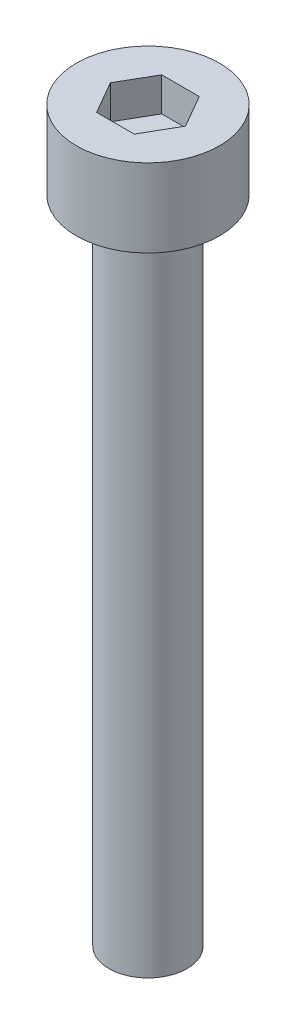
ISO-10303-21;
HEADER;
FILE_DESCRIPTION(('STEP AP214'),'2;1');
FILE_NAME('part.step','',(''),(''),'','','');
FILE_SCHEMA(('AUTOMOTIVE_DESIGN { 1 0 10303 214 1 1 1 1 }'));
ENDSEC;
DATA;
#1=APPLICATION_CONTEXT('core data for automotive mechanical design processes');
#2=APPLICATION_PROTOCOL_DEFINITION('international standard','automotive_design',2000,#1);
#3=PRODUCT_CONTEXT('',#1,'mechanical');
#4=PRODUCT('Part','Part','',(#3));
#5=PRODUCT_RELATED_PRODUCT_CATEGORY('part','',(#4));
#6=PRODUCT_DEFINITION_FORMATION('','',#4);
#7=PRODUCT_DEFINITION_CONTEXT('part definition',#1,'design');
#8=PRODUCT_DEFINITION('design','',#6,#7);
#9=PRODUCT_DEFINITION_SHAPE('','',#8);
#10=(LENGTH_UNIT() NAMED_UNIT(*) SI_UNIT(.MILLI.,.METRE.));
#11=(NAMED_UNIT(*) PLANE_ANGLE_UNIT() SI_UNIT($,.RADIAN.));
#12=(NAMED_UNIT(*) SI_UNIT($,.STERADIAN.) SOLID_ANGLE_UNIT());
#13=UNCERTAINTY_MEASURE_WITH_UNIT(LENGTH_MEASURE(1.E-05),#10,'distance_accuracy_value','');
#14=(GEOMETRIC_REPRESENTATION_CONTEXT(3) GLOBAL_UNCERTAINTY_ASSIGNED_CONTEXT((#13)) GLOBAL_UNIT_ASSIGNED_CONTEXT((#10,
#11,#12)) REPRESENTATION_CONTEXT('',''));
#15=CARTESIAN_POINT('',(0.,0.,0.));
#16=DIRECTION('',(0.,0.,1.));
#17=DIRECTION('',(1.,0.,0.));
#18=AXIS2_PLACEMENT_3D('',#15,#16,#17);
#19=CARTESIAN_POINT('',(0.,3.,0.));
#20=DIRECTION('',(0.,-1.,0.));
#21=DIRECTION('',(0.,0.,-1.));
#22=AXIS2_PLACEMENT_3D('',#19,#20,#21);
#23=CYLINDRICAL_SURFACE('',#22,2.75);
#24=CARTESIAN_POINT('',(0.,3.,0.));
#25=DIRECTION('',(0.,1.,0.));
#26=DIRECTION('',(0.,0.,1.));
#27=AXIS2_PLACEMENT_3D('',#24,#25,#26);
#28=CIRCLE('',#27,2.75);
#29=CARTESIAN_POINT('',(0.,3.,2.75));
#30=VERTEX_POINT('',#29);
#31=EDGE_CURVE('E45',#30,#30,#28,.T.);
#32=ORIENTED_EDGE('',*,*,#31,.F.);
#33=EDGE_LOOP('',(#32));
#34=FACE_BOUND('',#33,.T.);
#35=CARTESIAN_POINT('',(0.,0.,0.));
#36=DIRECTION('',(0.,1.,0.));
#37=DIRECTION('',(0.,0.,1.));
#38=AXIS2_PLACEMENT_3D('',#35,#36,#37);
#39=CIRCLE('',#38,2.75);
#40=CARTESIAN_POINT('',(0.,0.,2.75));
#41=VERTEX_POINT('',#40);
#42=EDGE_CURVE('E40',#41,#41,#39,.T.);
#43=ORIENTED_EDGE('',*,*,#42,.T.);
#44=EDGE_LOOP('',(#43));
#45=FACE_BOUND('',#44,.T.);
#46=ADVANCED_FACE('F37',(#34,#45),#23,.T.);
#47=CARTESIAN_POINT('',(0.,3.,0.));
#48=DIRECTION('',(0.,1.,0.));
#49=DIRECTION('',(0.,0.,1.));
#50=AXIS2_PLACEMENT_3D('',#47,#48,#49);
#51=PLANE('',#50);
#52=DIRECTION('',(0.5,0.,-0.866025403784439));
#53=VECTOR('',#52,1.);
#54=CARTESIAN_POINT('',(0.721687836487032,3.,1.25));
#55=LINE('',#54,#53);
#56=CARTESIAN_POINT('',(0.721687836487032,3.,1.25));
#57=VERTEX_POINT('',#56);
#58=CARTESIAN_POINT('',(1.44337567297406,3.,0.));
#59=VERTEX_POINT('',#58);
#60=EDGE_CURVE('E53',#57,#59,#55,.T.);
#61=ORIENTED_EDGE('',*,*,#60,.F.);
#62=DIRECTION('',(1.,0.,0.));
#63=VECTOR('',#62,1.);
#64=CARTESIAN_POINT('',(-0.721687836487033,3.,1.25));
#65=LINE('',#64,#63);
#66=CARTESIAN_POINT('',(-0.721687836487033,3.,1.25));
#67=VERTEX_POINT('',#66);
#68=EDGE_CURVE('E137',#67,#57,#65,.T.);
#69=ORIENTED_EDGE('',*,*,#68,.F.);
#70=DIRECTION('',(0.5,0.,0.866025403784439));
#71=VECTOR('',#70,1.);
#72=CARTESIAN_POINT('',(-1.44337567297407,3.,0.));
#73=LINE('',#72,#71);
#74=CARTESIAN_POINT('',(-1.44337567297407,3.,0.));
#75=VERTEX_POINT('',#74);
#76=EDGE_CURVE('E135',#75,#67,#73,.T.);
#77=ORIENTED_EDGE('',*,*,#76,.F.);
#78=DIRECTION('',(-0.5,0.,0.866025403784438));
#79=VECTOR('',#78,1.);
#80=CARTESIAN_POINT('',(-0.721687836487033,3.,-1.25));
#81=LINE('',#80,#79);
#82=CARTESIAN_POINT('',(-0.721687836487033,3.,-1.25));
#83=VERTEX_POINT('',#82);
#84=EDGE_CURVE('E101',#83,#75,#81,.T.);
#85=ORIENTED_EDGE('',*,*,#84,.F.);
#86=DIRECTION('',(-1.,0.,0.));
#87=VECTOR('',#86,1.);
#88=CARTESIAN_POINT('',(0.721687836487032,3.,-1.25));
#89=LINE('',#88,#87);
#90=CARTESIAN_POINT('',(0.721687836487032,3.,-1.25));
#91=VERTEX_POINT('',#90);
#92=EDGE_CURVE('E131',#91,#83,#89,.T.);
#93=ORIENTED_EDGE('',*,*,#92,.F.);
#94=DIRECTION('',(-0.5,0.,-0.866025403784439));
#95=VECTOR('',#94,1.);
#96=CARTESIAN_POINT('',(1.44337567297406,3.,0.));
#97=LINE('',#96,#95);
#98=EDGE_CURVE('E127',#59,#91,#97,.T.);
#99=ORIENTED_EDGE('',*,*,#98,.F.);
#100=EDGE_LOOP('',(#61,#69,#77,#85,#93,#99));
#101=FACE_BOUND('',#100,.T.);
#102=ORIENTED_EDGE('',*,*,#31,.T.);
#103=EDGE_LOOP('',(#102));
#104=FACE_BOUND('',#103,.T.);
#105=ADVANCED_FACE('F155',(#101,#104),#51,.T.);
#106=CARTESIAN_POINT('',(0.,0.,0.));
#107=DIRECTION('',(0.,1.,0.));
#108=DIRECTION('',(0.,0.,1.));
#109=AXIS2_PLACEMENT_3D('',#106,#107,#108);
#110=PLANE('',#109);
#111=CARTESIAN_POINT('',(0.,0.,0.));
#112=DIRECTION('',(0.,-1.,0.));
#113=DIRECTION('',(0.,0.,-1.));
#114=AXIS2_PLACEMENT_3D('',#111,#112,#113);
#115=CIRCLE('',#114,1.5);
#116=CARTESIAN_POINT('',(0.,0.,-1.5));
#117=VERTEX_POINT('',#116);
#118=EDGE_CURVE('E11',#117,#117,#115,.T.);
#119=ORIENTED_EDGE('',*,*,#118,.F.);
#120=EDGE_LOOP('',(#119));
#121=FACE_BOUND('',#120,.T.);
#122=ORIENTED_EDGE('',*,*,#42,.F.);
#123=EDGE_LOOP('',(#122));
#124=FACE_BOUND('',#123,.T.);
#125=ADVANCED_FACE('F152',(#121,#124),#110,.F.);
#126=CARTESIAN_POINT('',(0.721687836487032,1.7,1.25));
#127=DIRECTION('',(0.866025403784439,0.,0.5));
#128=DIRECTION('',(0.5,0.,-0.866025403784439));
#129=AXIS2_PLACEMENT_3D('',#126,#127,#128);
#130=PLANE('',#129);
#131=ORIENTED_EDGE('',*,*,#60,.T.);
#132=DIRECTION('',(0.,1.,0.));
#133=VECTOR('',#132,1.);
#134=CARTESIAN_POINT('',(1.44337567297406,1.7,0.));
#135=LINE('',#134,#133);
#136=CARTESIAN_POINT('',(1.44337567297406,1.7,0.));
#137=VERTEX_POINT('',#136);
#138=EDGE_CURVE('E83',#137,#59,#135,.T.);
#139=ORIENTED_EDGE('',*,*,#138,.F.);
#140=DIRECTION('',(0.5,0.,-0.866025403784439));
#141=VECTOR('',#140,1.);
#142=CARTESIAN_POINT('',(0.721687836487032,1.7,1.25));
#143=LINE('',#142,#141);
#144=CARTESIAN_POINT('',(0.721687836487032,1.7,1.25));
#145=VERTEX_POINT('',#144);
#146=EDGE_CURVE('E139',#145,#137,#143,.T.);
#147=ORIENTED_EDGE('',*,*,#146,.F.);
#148=DIRECTION('',(0.,1.,0.));
#149=VECTOR('',#148,1.);
#150=CARTESIAN_POINT('',(0.721687836487032,1.7,1.25));
#151=LINE('',#150,#149);
#152=EDGE_CURVE('E61',#145,#57,#151,.T.);
#153=ORIENTED_EDGE('',*,*,#152,.T.);
#154=EDGE_LOOP('',(#131,#139,#147,#153));
#155=FACE_BOUND('',#154,.T.);
#156=ADVANCED_FACE('F154',(#155),#130,.F.);
#157=CARTESIAN_POINT('',(-0.721687836487033,1.7,1.25));
#158=DIRECTION('',(0.,0.,1.));
#159=DIRECTION('',(1.,0.,0.));
#160=AXIS2_PLACEMENT_3D('',#157,#158,#159);
#161=PLANE('',#160);
#162=ORIENTED_EDGE('',*,*,#68,.T.);
#163=ORIENTED_EDGE('',*,*,#152,.F.);
#164=DIRECTION('',(1.,0.,0.));
#165=VECTOR('',#164,1.);
#166=CARTESIAN_POINT('',(-0.721687836487033,1.7,1.25));
#167=LINE('',#166,#165);
#168=CARTESIAN_POINT('',(-0.721687836487033,1.7,1.25));
#169=VERTEX_POINT('',#168);
#170=EDGE_CURVE('E113',#169,#145,#167,.T.);
#171=ORIENTED_EDGE('',*,*,#170,.F.);
#172=DIRECTION('',(0.,1.,0.));
#173=VECTOR('',#172,1.);
#174=CARTESIAN_POINT('',(-0.721687836487033,1.7,1.25));
#175=LINE('',#174,#173);
#176=EDGE_CURVE('E105',#169,#67,#175,.T.);
#177=ORIENTED_EDGE('',*,*,#176,.T.);
#178=EDGE_LOOP('',(#162,#163,#171,#177));
#179=FACE_BOUND('',#178,.T.);
#180=ADVANCED_FACE('F161',(#179),#161,.F.);
#181=CARTESIAN_POINT('',(-1.44337567297407,1.7,0.));
#182=DIRECTION('',(-0.866025403784439,0.,0.5));
#183=DIRECTION('',(0.5,0.,0.866025403784439));
#184=AXIS2_PLACEMENT_3D('',#181,#182,#183);
#185=PLANE('',#184);
#186=ORIENTED_EDGE('',*,*,#76,.T.);
#187=ORIENTED_EDGE('',*,*,#176,.F.);
#188=DIRECTION('',(0.5,0.,0.866025403784439));
#189=VECTOR('',#188,1.);
#190=CARTESIAN_POINT('',(-1.44337567297407,1.7,0.));
#191=LINE('',#190,#189);
#192=CARTESIAN_POINT('',(-1.44337567297407,1.7,0.));
#193=VERTEX_POINT('',#192);
#194=EDGE_CURVE('E109',#193,#169,#191,.T.);
#195=ORIENTED_EDGE('',*,*,#194,.F.);
#196=DIRECTION('',(0.,1.,0.));
#197=VECTOR('',#196,1.);
#198=CARTESIAN_POINT('',(-1.44337567297407,1.7,0.));
#199=LINE('',#198,#197);
#200=EDGE_CURVE('E94',#193,#75,#199,.T.);
#201=ORIENTED_EDGE('',*,*,#200,.T.);
#202=EDGE_LOOP('',(#186,#187,#195,#201));
#203=FACE_BOUND('',#202,.T.);
#204=ADVANCED_FACE('F110',(#203),#185,.F.);
#205=CARTESIAN_POINT('',(-0.721687836487033,1.7,-1.25));
#206=DIRECTION('',(-0.866025403784439,0.,-0.5));
#207=DIRECTION('',(-0.5,0.,0.866025403784439));
#208=AXIS2_PLACEMENT_3D('',#205,#206,#207);
#209=PLANE('',#208);
#210=ORIENTED_EDGE('',*,*,#84,.T.);
#211=ORIENTED_EDGE('',*,*,#200,.F.);
#212=DIRECTION('',(-0.5,0.,0.866025403784438));
#213=VECTOR('',#212,1.);
#214=CARTESIAN_POINT('',(-0.721687836487033,1.7,-1.25));
#215=LINE('',#214,#213);
#216=CARTESIAN_POINT('',(-0.721687836487033,1.7,-1.25));
#217=VERTEX_POINT('',#216);
#218=EDGE_CURVE('E98',#217,#193,#215,.T.);
#219=ORIENTED_EDGE('',*,*,#218,.F.);
#220=DIRECTION('',(0.,1.,0.));
#221=VECTOR('',#220,1.);
#222=CARTESIAN_POINT('',(-0.721687836487033,1.7,-1.25));
#223=LINE('',#222,#221);
#224=EDGE_CURVE('E106',#217,#83,#223,.T.);
#225=ORIENTED_EDGE('',*,*,#224,.T.);
#226=EDGE_LOOP('',(#210,#211,#219,#225));
#227=FACE_BOUND('',#226,.T.);
#228=ADVANCED_FACE('F96',(#227),#209,.F.);
#229=CARTESIAN_POINT('',(0.721687836487032,1.7,-1.25));
#230=DIRECTION('',(0.,0.,-1.));
#231=DIRECTION('',(-1.,0.,0.));
#232=AXIS2_PLACEMENT_3D('',#229,#230,#231);
#233=PLANE('',#232);
#234=ORIENTED_EDGE('',*,*,#92,.T.);
#235=ORIENTED_EDGE('',*,*,#224,.F.);
#236=DIRECTION('',(-1.,0.,0.));
#237=VECTOR('',#236,1.);
#238=CARTESIAN_POINT('',(0.721687836487032,1.7,-1.25));
#239=LINE('',#238,#237);
#240=CARTESIAN_POINT('',(0.721687836487032,1.7,-1.25));
#241=VERTEX_POINT('',#240);
#242=EDGE_CURVE('E119',#241,#217,#239,.T.);
#243=ORIENTED_EDGE('',*,*,#242,.F.);
#244=DIRECTION('',(0.,1.,0.));
#245=VECTOR('',#244,1.);
#246=CARTESIAN_POINT('',(0.721687836487032,1.7,-1.25));
#247=LINE('',#246,#245);
#248=EDGE_CURVE('E143',#241,#91,#247,.T.);
#249=ORIENTED_EDGE('',*,*,#248,.T.);
#250=EDGE_LOOP('',(#234,#235,#243,#249));
#251=FACE_BOUND('',#250,.T.);
#252=ADVANCED_FACE('F206',(#251),#233,.F.);
#253=CARTESIAN_POINT('',(1.44337567297406,1.7,0.));
#254=DIRECTION('',(0.866025403784439,0.,-0.5));
#255=DIRECTION('',(-0.5,0.,-0.866025403784439));
#256=AXIS2_PLACEMENT_3D('',#253,#254,#255);
#257=PLANE('',#256);
#258=ORIENTED_EDGE('',*,*,#98,.T.);
#259=ORIENTED_EDGE('',*,*,#248,.F.);
#260=DIRECTION('',(-0.5,0.,-0.866025403784439));
#261=VECTOR('',#260,1.);
#262=CARTESIAN_POINT('',(1.44337567297406,1.7,0.));
#263=LINE('',#262,#261);
#264=EDGE_CURVE('E121',#137,#241,#263,.T.);
#265=ORIENTED_EDGE('',*,*,#264,.F.);
#266=ORIENTED_EDGE('',*,*,#138,.T.);
#267=EDGE_LOOP('',(#258,#259,#265,#266));
#268=FACE_BOUND('',#267,.T.);
#269=ADVANCED_FACE('F215',(#268),#257,.F.);
#270=CARTESIAN_POINT('',(0.,1.7,0.));
#271=DIRECTION('',(0.,1.,0.));
#272=DIRECTION('',(0.,0.,1.));
#273=AXIS2_PLACEMENT_3D('',#270,#271,#272);
#274=PLANE('',#273);
#275=ORIENTED_EDGE('',*,*,#146,.T.);
#276=ORIENTED_EDGE('',*,*,#264,.T.);
#277=ORIENTED_EDGE('',*,*,#242,.T.);
#278=ORIENTED_EDGE('',*,*,#218,.T.);
#279=ORIENTED_EDGE('',*,*,#194,.T.);
#280=ORIENTED_EDGE('',*,*,#170,.T.);
#281=EDGE_LOOP('',(#275,#276,#277,#278,#279,#280));
#282=FACE_BOUND('',#281,.T.);
#283=ADVANCED_FACE('F116',(#282),#274,.T.);
#284=CARTESIAN_POINT('',(0.,-25.,0.));
#285=DIRECTION('',(0.,1.,0.));
#286=DIRECTION('',(0.,0.,1.));
#287=AXIS2_PLACEMENT_3D('',#284,#285,#286);
#288=CYLINDRICAL_SURFACE('',#287,1.5);
#289=CARTESIAN_POINT('',(0.,-25.,0.));
#290=DIRECTION('',(0.,-1.,0.));
#291=DIRECTION('',(0.,0.,-1.));
#292=AXIS2_PLACEMENT_3D('',#289,#290,#291);
#293=CIRCLE('',#292,1.5);
#294=CARTESIAN_POINT('',(0.,-25.,-1.5));
#295=VERTEX_POINT('',#294);
#296=EDGE_CURVE('E128',#295,#295,#293,.T.);
#297=ORIENTED_EDGE('',*,*,#296,.F.);
#298=EDGE_LOOP('',(#297));
#299=FACE_BOUND('',#298,.T.);
#300=ORIENTED_EDGE('',*,*,#118,.T.);
#301=EDGE_LOOP('',(#300));
#302=FACE_BOUND('',#301,.T.);
#303=ADVANCED_FACE('F233',(#299,#302),#288,.T.);
#304=CARTESIAN_POINT('',(0.,-25.,0.));
#305=DIRECTION('',(0.,-1.,0.));
#306=DIRECTION('',(0.,0.,-1.));
#307=AXIS2_PLACEMENT_3D('',#304,#305,#306);
#308=PLANE('',#307);
#309=ORIENTED_EDGE('',*,*,#296,.T.);
#310=EDGE_LOOP('',(#309));
#311=FACE_BOUND('',#310,.T.);
#312=ADVANCED_FACE('F247',(#311),#308,.T.);
#313=CLOSED_SHELL('',(#46,#105,#125,#156,#180,#204,#228,#252,#269,#283,#303,#312));
#314=MANIFOLD_SOLID_BREP('B2',#313);
#315=ADVANCED_BREP_SHAPE_REPRESENTATION('',(#18,#314),#14);
#316=SHAPE_DEFINITION_REPRESENTATION(#9,#315);
ENDSEC;
END-ISO-10303-21;
